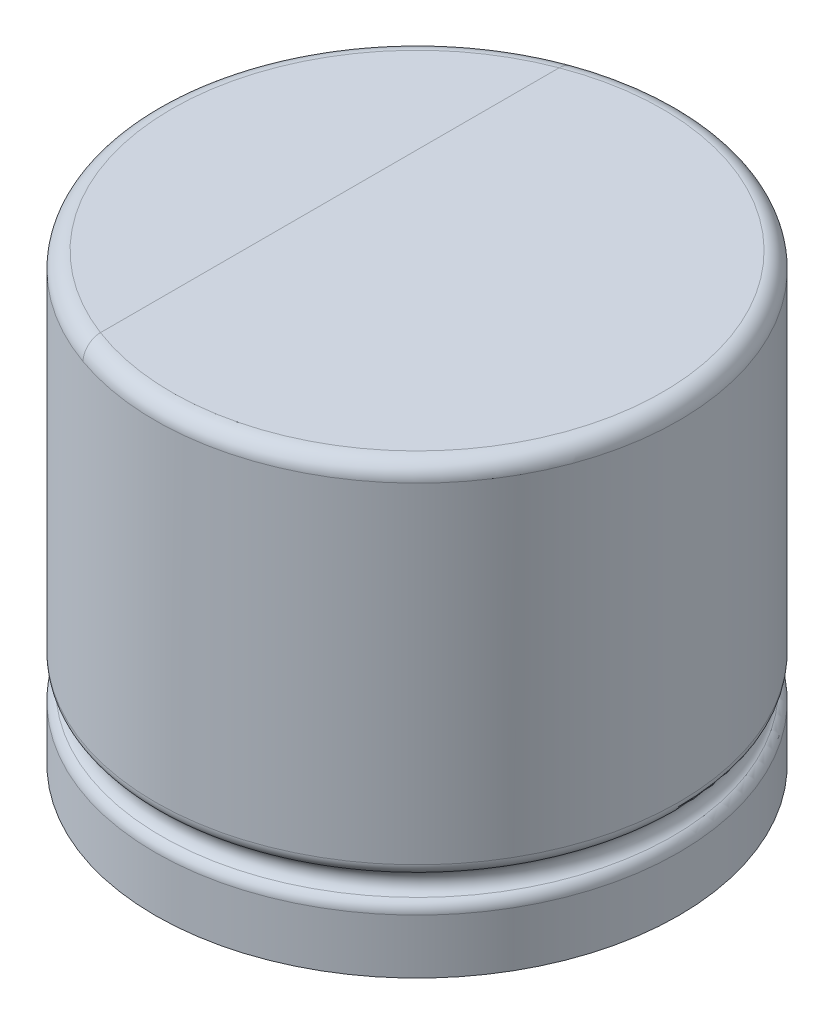
ISO-10303-21;
HEADER;
FILE_DESCRIPTION(('STEP AP214'),'2;1');
FILE_NAME('part.step','',(''),(''),'','','');
FILE_SCHEMA(('AUTOMOTIVE_DESIGN { 1 0 10303 214 1 1 1 1 }'));
ENDSEC;
DATA;
#1=APPLICATION_CONTEXT('core data for automotive mechanical design processes');
#2=APPLICATION_PROTOCOL_DEFINITION('international standard','automotive_design',2000,#1);
#3=PRODUCT_CONTEXT('',#1,'mechanical');
#4=PRODUCT('Part','Part','',(#3));
#5=PRODUCT_RELATED_PRODUCT_CATEGORY('part','',(#4));
#6=PRODUCT_DEFINITION_FORMATION('','',#4);
#7=PRODUCT_DEFINITION_CONTEXT('part definition',#1,'design');
#8=PRODUCT_DEFINITION('design','',#6,#7);
#9=PRODUCT_DEFINITION_SHAPE('','',#8);
#10=(LENGTH_UNIT() NAMED_UNIT(*) SI_UNIT(.MILLI.,.METRE.));
#11=(NAMED_UNIT(*) PLANE_ANGLE_UNIT() SI_UNIT($,.RADIAN.));
#12=(NAMED_UNIT(*) SI_UNIT($,.STERADIAN.) SOLID_ANGLE_UNIT());
#13=UNCERTAINTY_MEASURE_WITH_UNIT(LENGTH_MEASURE(1.E-05),#10,'distance_accuracy_value','');
#14=(GEOMETRIC_REPRESENTATION_CONTEXT(3) GLOBAL_UNCERTAINTY_ASSIGNED_CONTEXT((#13)) GLOBAL_UNIT_ASSIGNED_CONTEXT((#10,
#11,#12)) REPRESENTATION_CONTEXT('',''));
#15=CARTESIAN_POINT('',(0.,0.,0.));
#16=DIRECTION('',(0.,0.,1.));
#17=DIRECTION('',(1.,0.,0.));
#18=AXIS2_PLACEMENT_3D('',#15,#16,#17);
#19=CARTESIAN_POINT('',(0.,3.775,0.));
#20=DIRECTION('',(0.,-1.,0.));
#21=DIRECTION('',(1.,0.,0.));
#22=AXIS2_PLACEMENT_3D('',#19,#20,#21);
#23=TOROIDAL_SURFACE('',#22,1.875,0.125);
#24=CARTESIAN_POINT('',(0.,3.9,0.));
#25=DIRECTION('',(0.,-1.,0.));
#26=DIRECTION('',(1.,0.,0.));
#27=AXIS2_PLACEMENT_3D('',#24,#25,#26);
#28=CIRCLE('',#27,1.875);
#29=CARTESIAN_POINT('',(-0.666666666666666,3.9,-1.75247840373442));
#30=VERTEX_POINT('',#29);
#31=CARTESIAN_POINT('',(-0.666666666666666,3.9,1.75247840373442));
#32=VERTEX_POINT('',#31);
#33=EDGE_CURVE('E78',#30,#32,#28,.F.);
#34=ORIENTED_EDGE('',*,*,#33,.F.);
#35=CARTESIAN_POINT('',(-0.666666666666666,3.82818405447085,-1.87301424134918));
#36=CARTESIAN_POINT('',(-0.666666666666666,3.82220378949174,-1.87599836917153));
#37=CARTESIAN_POINT('',(-0.666666666666666,3.8159736785829,-1.87849018178));
#38=CARTESIAN_POINT('',(-0.666666666666666,3.80318033587419,-1.88239780078043));
#39=CARTESIAN_POINT('',(-0.666666666666666,3.7966168636358,-1.8838128184264));
#40=CARTESIAN_POINT('',(-0.666666666666666,3.78334184590753,-1.88551247272468));
#41=CARTESIAN_POINT('',(-0.666666666666666,3.77663024651199,-1.88579669080732));
#42=CARTESIAN_POINT('',(-0.666666666666666,3.76325744151217,-1.88522246223916));
#43=CARTESIAN_POINT('',(-0.666666666666666,3.75659622765533,-1.88436420697432));
#44=CARTESIAN_POINT('',(-0.666666666666666,3.74357097969995,-1.88155026522605));
#45=CARTESIAN_POINT('',(-0.666666666666666,3.73720487443214,-1.87960412946247));
#46=CARTESIAN_POINT('',(-0.666666666666666,3.7248803062502,-1.87469118754634));
#47=CARTESIAN_POINT('',(-0.666666666666666,3.71892187388207,-1.87172430501173));
#48=CARTESIAN_POINT('',(-0.666666666666666,3.70744704944748,-1.86480082139048));
#49=CARTESIAN_POINT('',(-0.666666666666666,3.70194198622153,-1.86082547894449));
#50=CARTESIAN_POINT('',(-0.666666666666666,3.69163935747781,-1.85204580705027));
#51=CARTESIAN_POINT('',(-0.666666666666666,3.68684192651719,-1.84724132031514));
#52=CARTESIAN_POINT('',(-0.666666666666666,3.67784441318641,-1.83670061253256));
#53=CARTESIAN_POINT('',(-0.666666666666666,3.67368349384132,-1.83093099013994));
#54=CARTESIAN_POINT('',(-0.666666666666666,3.66632618627092,-1.81880710639214));
#55=CARTESIAN_POINT('',(-0.666666666666666,3.66313005263974,-1.81245269129418));
#56=CARTESIAN_POINT('',(-0.666666666666666,3.65759555785682,-1.79893961078548));
#57=CARTESIAN_POINT('',(-0.666666666666666,3.65531903270807,-1.79175560988745));
#58=CARTESIAN_POINT('',(-0.666666666666666,3.65194002151267,-1.77711659255158));
#59=CARTESIAN_POINT('',(-0.666666666666666,3.65083785626396,-1.76966150263565));
#60=CARTESIAN_POINT('',(-0.666666666666666,3.64979377068687,-1.75429408830695));
#61=CARTESIAN_POINT('',(-0.666666666666666,3.64991278359446,-1.74637757758675));
#62=CARTESIAN_POINT('',(-0.666666666666666,3.65145039163617,-1.7306707109262));
#63=CARTESIAN_POINT('',(-0.666666666666666,3.65286923426461,-1.72288037929849));
#64=CARTESIAN_POINT('',(-0.666666666666666,3.65701827732434,-1.70749400569282));
#65=CARTESIAN_POINT('',(-0.666666666666666,3.65977322662498,-1.69990460279199));
#66=CARTESIAN_POINT('',(-0.666666666666666,3.66655132269711,-1.68531276226582));
#67=CARTESIAN_POINT('',(-0.666666666666666,3.6705744082658,-1.67831029633437));
#68=CARTESIAN_POINT('',(-0.666666666666666,3.67968164802173,-1.66530564748759));
#69=CARTESIAN_POINT('',(-0.666666666666666,3.68473494163925,-1.65928191555198));
#70=CARTESIAN_POINT('',(-0.666666666666666,3.69584548157831,-1.64824314939253));
#71=CARTESIAN_POINT('',(-0.666666666666666,3.7019023002272,-1.64322768748057));
#72=CARTESIAN_POINT('',(-0.666666666666666,3.71442172802686,-1.63471368758406));
#73=CARTESIAN_POINT('',(-0.666666666666666,3.72083094458236,-1.63113671935295));
#74=CARTESIAN_POINT('',(-0.666666666666666,3.73419285278215,-1.62520766784083));
#75=CARTESIAN_POINT('',(-0.666666666666666,3.74114525032432,-1.6228549269234));
#76=CARTESIAN_POINT('',(-0.666666666666666,3.75484865047754,-1.61960928837895));
#77=CARTESIAN_POINT('',(-0.666666666666666,3.76157755456963,-1.61862270266717));
#78=CARTESIAN_POINT('',(-0.666666666666666,3.77510352473261,-1.61784259513277));
#79=CARTESIAN_POINT('',(-0.666666666666666,3.78190057185393,-1.61804875033633));
#80=CARTESIAN_POINT('',(-0.666666666666666,3.79509778475981,-1.61961370156934));
#81=CARTESIAN_POINT('',(-0.666666666666666,3.80150323267639,-1.62092855274267));
#82=CARTESIAN_POINT('',(-0.666666666666666,3.81400760615145,-1.62459919495037));
#83=CARTESIAN_POINT('',(-0.666666666666666,3.82010652345878,-1.6269550139887));
#84=CARTESIAN_POINT('',(-0.666666666666666,3.83193448943692,-1.63266246000846));
#85=CARTESIAN_POINT('',(-0.666666666666666,3.83765633916544,-1.6360289572055));
#86=CARTESIAN_POINT('',(-0.666666666666666,3.84849385737944,-1.64362521055848));
#87=CARTESIAN_POINT('',(-0.666666666666666,3.85360939001308,-1.64785515960428));
#88=CARTESIAN_POINT('',(-0.666666666666666,3.86340626591912,-1.65731177384585));
#89=CARTESIAN_POINT('',(-0.666666666666666,3.86804575762332,-1.66258175119738));
#90=CARTESIAN_POINT('',(-0.666666666666666,3.87644508294144,-1.67378078227073));
#91=CARTESIAN_POINT('',(-0.666666666666666,3.88020463556838,-1.67971004563026));
#92=CARTESIAN_POINT('',(-0.666666666666666,3.88701724649157,-1.692512880006));
#93=CARTESIAN_POINT('',(-0.666666666666666,3.89000041514573,-1.69942366909962));
#94=CARTESIAN_POINT('',(-0.666666666666666,3.89483304545837,-1.71363104068431));
#95=CARTESIAN_POINT('',(-0.666666666666666,3.89668216590303,-1.72092773857148));
#96=CARTESIAN_POINT('',(-0.666666666666666,3.89928362280009,-1.73612753238553));
#97=CARTESIAN_POINT('',(-0.666666666666666,3.89997026371915,-1.7440419408726));
#98=CARTESIAN_POINT('',(-0.666666666666666,3.9000278518694,-1.75987631159834));
#99=CARTESIAN_POINT('',(-0.666666666666666,3.89939863591298,-1.76779627440407));
#100=CARTESIAN_POINT('',(-0.666666666666666,3.89680807836945,-1.78354047092162));
#101=CARTESIAN_POINT('',(-0.666666666666666,3.89482667237237,-1.7913614295894));
#102=CARTESIAN_POINT('',(-0.666666666666666,3.8895397617829,-1.80654630054681));
#103=CARTESIAN_POINT('',(-0.666666666666666,3.88623404623419,-1.8139101398035));
#104=CARTESIAN_POINT('',(-0.666666666666666,3.87847679381382,-1.82773367746721));
#105=CARTESIAN_POINT('',(-0.666666666666666,3.87406047897215,-1.83421311935853));
#106=CARTESIAN_POINT('',(-0.666666666666666,3.86414417413304,-1.84627309792243));
#107=CARTESIAN_POINT('',(-0.666666666666666,3.85864598146363,-1.85185509794345));
#108=CARTESIAN_POINT('',(-0.666666666666666,3.8489369949788,-1.86003947772965));
#109=CARTESIAN_POINT('',(-0.666666666666666,3.84500566965683,-1.86297885266937));
#110=CARTESIAN_POINT('',(-0.666666666666666,3.83682237020493,-1.86837182836929));
#111=CARTESIAN_POINT('',(-0.666666666666666,3.83257041876749,-1.87082546346353));
#112=CARTESIAN_POINT('',(-0.666666666666666,3.82818405447085,-1.87301424134918));
#113=B_SPLINE_CURVE_WITH_KNOTS('',3,(#35,#36,#37,#38,#39,#40,#41,#42,#43,#44,#45,#46,#47,#48,
#49,#50,#51,#52,#53,#54,#55,#56,#57,#58,#59,#60,#61,#62,#63,#64,#65,#66,#67,#68,#69,#70,#71,#72,
#73,#74,#75,#76,#77,#78,#79,#80,#81,#82,#83,#84,#85,#86,#87,#88,#89,#90,#91,#92,#93,#94,#95,#96,
#97,#98,#99,#100,#101,#102,#103,#104,#105,#106,#107,#108,#109,#110,#111,#112),.UNSPECIFIED.,.T.,
.F.,(4,2,2,2,2,2,2,2,2,2,2,2,2,2,2,2,2,2,2,2,2,2,2,2,2,2,2,2,2,2,2,2,2,2,2,2,2,2,4),(0.,
0.0200331153309485,0.0400808907137164,0.0601360861653706,0.0801879224140654,0.100066423439525,
0.119946412288637,0.140227054916742,0.160511548976644,0.181758877687329,0.203011808394073,
0.225520411649499,0.248035161967483,0.271678583774686,0.295326508348133,0.319430238841597,
0.343532806218867,0.366998225037598,0.390453669191701,0.412356642244206,0.434247837172202,
0.454547691158985,0.474842048550099,0.494367881327073,0.513894239417104,0.53372328098479,
0.553556757096042,0.574530123613579,0.595510178352282,0.617992928702707,0.640482440376354,
0.664205048562899,0.687930598912524,0.712016081489848,0.736105402298725,0.759510325448877,
0.782876689282317,0.797571482236727,0.812265236133134),.UNSPECIFIED.);
#114=CARTESIAN_POINT('',(-0.666666666666666,3.775,-1.88561808316413));
#115=VERTEX_POINT('',#114);
#116=EDGE_CURVE('E11',#30,#115,#113,.T.);
#117=ORIENTED_EDGE('',*,*,#116,.T.);
#118=CARTESIAN_POINT('',(0.,3.775,0.));
#119=DIRECTION('',(0.,-1.,0.));
#120=DIRECTION('',(1.,0.,0.));
#121=AXIS2_PLACEMENT_3D('',#118,#119,#120);
#122=CIRCLE('',#121,2.);
#123=CARTESIAN_POINT('',(-0.666666666666666,3.775,1.88561808316413));
#124=VERTEX_POINT('',#123);
#125=EDGE_CURVE('E83',#124,#115,#122,.T.);
#126=ORIENTED_EDGE('',*,*,#125,.F.);
#127=CARTESIAN_POINT('',(-0.666666666666666,3.79956255640499,1.62067612773196));
#128=CARTESIAN_POINT('',(-0.666666666666666,3.79317130974612,1.61929146965819));
#129=CARTESIAN_POINT('',(-0.666666666666666,3.78665926171825,1.61844439341232));
#130=CARTESIAN_POINT('',(-0.666666666666666,3.773581624128,1.6178638647447));
#131=CARTESIAN_POINT('',(-0.666666666666666,3.76701599226971,1.61813139886323));
#132=CARTESIAN_POINT('',(-0.666666666666666,3.75402957724054,1.61976941866287));
#133=CARTESIAN_POINT('',(-0.666666666666666,3.74760867621762,1.6211389709796));
#134=CARTESIAN_POINT('',(-0.666666666666666,3.73508500035388,1.62492361071983));
#135=CARTESIAN_POINT('',(-0.666666666666666,3.72898219972996,1.62733861325794));
#136=CARTESIAN_POINT('',(-0.666666666666666,3.71717433183171,1.6331588083544));
#137=CARTESIAN_POINT('',(-0.666666666666666,3.71147524250004,1.6365760898937));
#138=CARTESIAN_POINT('',(-0.666666666666666,3.70069041959812,1.64426898649964));
#139=CARTESIAN_POINT('',(-0.666666666666666,3.69560482558833,1.64854479628061));
#140=CARTESIAN_POINT('',(-0.666666666666666,3.68587173097454,1.65809376626394));
#141=CARTESIAN_POINT('',(-0.666666666666666,3.68126706449193,1.66341054281063));
#142=CARTESIAN_POINT('',(-0.666666666666666,3.67294427916246,1.67469721104688));
#143=CARTESIAN_POINT('',(-0.666666666666666,3.6692264469322,1.6806673129782));
#144=CARTESIAN_POINT('',(-0.666666666666666,3.66250672491225,1.69354752529332));
#145=CARTESIAN_POINT('',(-0.666666666666666,3.65957511436002,1.7004943313314));
#146=CARTESIAN_POINT('',(-0.666666666666666,3.65485158234335,1.71476532977014));
#147=CARTESIAN_POINT('',(-0.666666666666666,3.65305999820317,1.72208963317676));
#148=CARTESIAN_POINT('',(-0.666666666666666,3.6505831141384,1.73733065732365));
#149=CARTESIAN_POINT('',(-0.666666666666666,3.64996279863653,1.74525800774872));
#150=CARTESIAN_POINT('',(-0.666666666666666,3.65004066772871,1.76110730592935));
#151=CARTESIAN_POINT('',(-0.666666666666666,3.65073905805042,1.76902925264902));
#152=CARTESIAN_POINT('',(-0.666666666666666,3.65346936037002,1.78475691726484));
#153=CARTESIAN_POINT('',(-0.666666666666666,3.65551994671776,1.79255941864692));
#154=CARTESIAN_POINT('',(-0.666666666666666,3.66094170086204,1.80769286276305));
#155=CARTESIAN_POINT('',(-0.666666666666666,3.66431272825127,1.81502385553787));
#156=CARTESIAN_POINT('',(-0.666666666666666,3.67218811798043,1.82876046970703));
#157=CARTESIAN_POINT('',(-0.666666666666666,3.67665553961067,1.83518722040471));
#158=CARTESIAN_POINT('',(-0.666666666666666,3.68666736577195,1.84713990522625));
#159=CARTESIAN_POINT('',(-0.666666666666666,3.69221139079882,1.85266615551897));
#160=CARTESIAN_POINT('',(-0.666666666666666,3.70387565575397,1.86231314490482));
#161=CARTESIAN_POINT('',(-0.666666666666666,3.7099438310382,1.86649680962946));
#162=CARTESIAN_POINT('',(-0.666666666666666,3.72273101455996,1.87371095902517));
#163=CARTESIAN_POINT('',(-0.666666666666666,3.72944976413965,1.87674189965811));
#164=CARTESIAN_POINT('',(-0.666666666666666,3.74291963715963,1.88138397743785));
#165=CARTESIAN_POINT('',(-0.666666666666666,3.74964567104303,1.8830680632042));
#166=CARTESIAN_POINT('',(-0.666666666666666,3.76328802567636,1.88523727593779));
#167=CARTESIAN_POINT('',(-0.666666666666666,3.77020429886944,1.8857226998464));
#168=CARTESIAN_POINT('',(-0.666666666666666,3.78377165589035,1.88548005116799));
#169=CARTESIAN_POINT('',(-0.666666666666666,3.79042353353868,1.8847939389435));
#170=CARTESIAN_POINT('',(-0.666666666666666,3.80351681897049,1.88231409736424));
#171=CARTESIAN_POINT('',(-0.666666666666666,3.80995823674354,1.8805204206611));
#172=CARTESIAN_POINT('',(-0.666666666666666,3.8224547914697,1.87589042706059));
#173=CARTESIAN_POINT('',(-0.666666666666666,3.82850986296367,1.87305393402511));
#174=CARTESIAN_POINT('',(-0.666666666666666,3.84007859168928,1.86643610963306));
#175=CARTESIAN_POINT('',(-0.666666666666666,3.84559218353078,1.86265466435719));
#176=CARTESIAN_POINT('',(-0.666666666666666,3.85612324613175,1.85412748139996));
#177=CARTESIAN_POINT('',(-0.666666666666666,3.86111807622109,1.84935382114359));
#178=CARTESIAN_POINT('',(-0.666666666666666,3.87028579778322,1.83907444783566));
#179=CARTESIAN_POINT('',(-0.666666666666666,3.87445850128344,1.8335685678489));
#180=CARTESIAN_POINT('',(-0.666666666666666,3.88210754626067,1.82166213185984));
#181=CARTESIAN_POINT('',(-0.666666666666666,3.88553334493048,1.81522911961735));
#182=CARTESIAN_POINT('',(-0.666666666666666,3.89132403036097,1.80190249547069));
#183=CARTESIAN_POINT('',(-0.666666666666666,3.89368861993104,1.7950087551603));
#184=CARTESIAN_POINT('',(-0.666666666666666,3.89742802401509,1.78053010637771));
#185=CARTESIAN_POINT('',(-0.666666666666666,3.89873750966564,1.7729282979033));
#186=CARTESIAN_POINT('',(-0.666666666666666,3.90011521101244,1.75761261835049));
#187=CARTESIAN_POINT('',(-0.666666666666666,3.90018311648165,1.74989871974658));
#188=CARTESIAN_POINT('',(-0.666666666666666,3.89906036534419,1.73425518274846));
#189=CARTESIAN_POINT('',(-0.666666666666666,3.8978198448036,1.72632907220027));
#190=CARTESIAN_POINT('',(-0.666666666666666,3.89402817358005,1.71079545715085));
#191=CARTESIAN_POINT('',(-0.666666666666666,3.89147692016856,1.70318797767284));
#192=CARTESIAN_POINT('',(-0.666666666666666,3.88511061256345,1.68851386002635));
#193=CARTESIAN_POINT('',(-0.666666666666666,3.88129477900252,1.68144755870333));
#194=CARTESIAN_POINT('',(-0.666666666666666,3.87247586271153,1.66809393658334));
#195=CARTESIAN_POINT('',(-0.666666666666666,3.86747270401985,1.66180666566567));
#196=CARTESIAN_POINT('',(-0.666666666666666,3.85665057300873,1.65051418839769));
#197=CARTESIAN_POINT('',(-0.666666666666666,3.85087873716912,1.64546385534327));
#198=CARTESIAN_POINT('',(-0.666666666666666,3.83851664556508,1.63650385420999));
#199=CARTESIAN_POINT('',(-0.666666666666666,3.83192799804019,1.63259199387251));
#200=CARTESIAN_POINT('',(-0.666666666666666,3.82097044503274,1.6274195142298));
#201=CARTESIAN_POINT('',(-0.666666666666666,3.81679942472739,1.62572954466143));
#202=CARTESIAN_POINT('',(-0.666666666666666,3.80829214371702,1.62283376823363));
#203=CARTESIAN_POINT('',(-0.666666666666666,3.80395589040117,1.62162793975132));
#204=CARTESIAN_POINT('',(-0.666666666666666,3.79956255640499,1.62067612773196));
#205=B_SPLINE_CURVE_WITH_KNOTS('',3,(#127,#128,#129,#130,#131,#132,#133,#134,#135,#136,#137,
#138,#139,#140,#141,#142,#143,#144,#145,#146,#147,#148,#149,#150,#151,#152,#153,#154,#155,#156,
#157,#158,#159,#160,#161,#162,#163,#164,#165,#166,#167,#168,#169,#170,#171,#172,#173,#174,#175,
#176,#177,#178,#179,#180,#181,#182,#183,#184,#185,#186,#187,#188,#189,#190,#191,#192,#193,#194,
#195,#196,#197,#198,#199,#200,#201,#202,#203,#204),.UNSPECIFIED.,.T.,.F.,(4,2,2,2,2,2,2,2,2,2,2,
2,2,2,2,2,2,2,2,2,2,2,2,2,2,2,2,2,2,2,2,2,2,2,2,2,2,2,4),(0.,0.0196021202708034,
0.039221594038596,0.0588244683822836,0.0784257513680005,0.0982739259947386,0.118126607285576,
0.139136852022749,0.160153877903413,0.182675016809758,0.205202816437367,0.228947478016636,
0.252695844241403,0.276779252970385,0.300860101517367,0.324220206447802,0.347572091808168,
0.369569681205391,0.391558560348751,0.412255662183122,0.43294763626378,0.452913941661108,
0.472879297969195,0.492848028099523,0.512819166734964,0.533455480098995,0.554096506326683,
0.575866000416849,0.597641587234901,0.620679597005952,0.643723363083604,0.667678174387619,
0.691634863433542,0.715606344654417,0.739579359914831,0.762468037836991,0.785312344880304,
0.798787416777597,0.812261886780023),.UNSPECIFIED.);
#206=EDGE_CURVE('E51',#124,#32,#205,.T.);
#207=ORIENTED_EDGE('',*,*,#206,.T.);
#208=EDGE_LOOP('',(#34,#117,#126,#207));
#209=FACE_BOUND('',#208,.T.);
#210=ADVANCED_FACE('F41',(#209),#23,.T.);
#211=CARTESIAN_POINT('',(0.,3.9,0.));
#212=DIRECTION('',(0.,-1.,0.));
#213=DIRECTION('',(1.,0.,0.));
#214=AXIS2_PLACEMENT_3D('',#211,#212,#213);
#215=PLANE('',#214);
#216=DIRECTION('',(0.,0.,1.));
#217=VECTOR('',#216,1.);
#218=CARTESIAN_POINT('',(-0.666666666666666,3.9,0.));
#219=LINE('',#218,#217);
#220=EDGE_CURVE('E45',#30,#32,#219,.T.);
#221=ORIENTED_EDGE('',*,*,#220,.F.);
#222=ORIENTED_EDGE('',*,*,#33,.T.);
#223=EDGE_LOOP('',(#221,#222));
#224=FACE_BOUND('',#223,.T.);
#225=ADVANCED_FACE('F77',(#224),#215,.F.);
#226=EDGE_CURVE('E71',#32,#30,#28,.F.);
#227=ORIENTED_EDGE('',*,*,#226,.T.);
#228=ORIENTED_EDGE('',*,*,#220,.T.);
#229=EDGE_LOOP('',(#227,#228));
#230=FACE_BOUND('',#229,.T.);
#231=ADVANCED_FACE('F81',(#230),#215,.F.);
#232=CARTESIAN_POINT('',(0.,0.500000000048987,0.));
#233=DIRECTION('',(0.,-1.,0.));
#234=DIRECTION('',(1.,0.,0.));
#235=AXIS2_PLACEMENT_3D('',#232,#233,#234);
#236=CYLINDRICAL_SURFACE('',#235,2.);
#237=ORIENTED_EDGE('',*,*,#125,.T.);
#238=EDGE_CURVE('E73',#115,#124,#122,.T.);
#239=ORIENTED_EDGE('',*,*,#238,.T.);
#240=EDGE_LOOP('',(#237,#239));
#241=FACE_BOUND('',#240,.T.);
#242=CARTESIAN_POINT('',(0.,1.25,0.));
#243=DIRECTION('',(0.,-1.,0.));
#244=DIRECTION('',(0.,0.,-1.));
#245=AXIS2_PLACEMENT_3D('',#242,#243,#244);
#246=CIRCLE('',#245,2.00000000000999);
#247=CARTESIAN_POINT('',(0.,1.25,-2.00000000000999));
#248=VERTEX_POINT('',#247);
#249=EDGE_CURVE('E222',#248,#248,#246,.T.);
#250=ORIENTED_EDGE('',*,*,#249,.F.);
#251=EDGE_LOOP('',(#250));
#252=FACE_BOUND('',#251,.T.);
#253=ADVANCED_FACE('F103',(#241,#252),#236,.T.);
#254=CARTESIAN_POINT('',(0.,1.25,0.));
#255=DIRECTION('',(0.,-1.,0.));
#256=DIRECTION('',(0.,0.,-1.));
#257=AXIS2_PLACEMENT_3D('',#254,#255,#256);
#258=TOROIDAL_SURFACE('',#257,1.90377495513173,0.0962250448732673);
#259=ORIENTED_EDGE('',*,*,#249,.T.);
#260=EDGE_LOOP('',(#259));
#261=FACE_BOUND('',#260,.T.);
#262=CARTESIAN_POINT('',(0.,1.16666666666667,0.));
#263=DIRECTION('',(0.,-1.,0.));
#264=DIRECTION('',(0.,0.,-1.));
#265=AXIS2_PLACEMENT_3D('',#262,#263,#264);
#266=CIRCLE('',#265,1.95188747757086);
#267=CARTESIAN_POINT('',(0.,1.16666666666667,-1.95188747757086));
#268=VERTEX_POINT('',#267);
#269=EDGE_CURVE('E225',#268,#268,#266,.T.);
#270=ORIENTED_EDGE('',*,*,#269,.F.);
#271=EDGE_LOOP('',(#270));
#272=FACE_BOUND('',#271,.T.);
#273=ADVANCED_FACE('F106',(#261,#272),#258,.T.);
#274=CARTESIAN_POINT('',(0.,1.08333333333333,0.));
#275=DIRECTION('',(0.,-1.,0.));
#276=DIRECTION('',(0.,0.,-1.));
#277=AXIS2_PLACEMENT_3D('',#274,#275,#276);
#278=TOROIDAL_SURFACE('',#277,2.00000000000999,0.0962250448682694);
#279=ORIENTED_EDGE('',*,*,#269,.T.);
#280=EDGE_LOOP('',(#279));
#281=FACE_BOUND('',#280,.T.);
#282=CARTESIAN_POINT('',(0.,1.00000000000433,0.));
#283=DIRECTION('',(0.,-1.,0.));
#284=DIRECTION('',(0.,0.,-1.));
#285=AXIS2_PLACEMENT_3D('',#282,#283,#284);
#286=CIRCLE('',#285,1.95188747757336);
#287=CARTESIAN_POINT('',(0.,1.00000000000433,-1.95188747757336));
#288=VERTEX_POINT('',#287);
#289=EDGE_CURVE('E221',#288,#288,#286,.T.);
#290=ORIENTED_EDGE('',*,*,#289,.F.);
#291=EDGE_LOOP('',(#290));
#292=FACE_BOUND('',#291,.T.);
#293=ADVANCED_FACE('F115',(#281,#292),#278,.F.);
#294=CARTESIAN_POINT('',(0.,0.916666666666667,0.));
#295=DIRECTION('',(0.,-1.,0.));
#296=DIRECTION('',(0.,0.,-1.));
#297=AXIS2_PLACEMENT_3D('',#294,#295,#296);
#298=TOROIDAL_SURFACE('',#297,1.90377495513173,0.0962250448732673);
#299=ORIENTED_EDGE('',*,*,#289,.T.);
#300=EDGE_LOOP('',(#299));
#301=FACE_BOUND('',#300,.T.);
#302=CARTESIAN_POINT('',(0.,0.916666666666667,0.));
#303=DIRECTION('',(0.,-1.,0.));
#304=DIRECTION('',(0.,0.,-1.));
#305=AXIS2_PLACEMENT_3D('',#302,#303,#304);
#306=CIRCLE('',#305,2.00000000000999);
#307=CARTESIAN_POINT('',(0.,0.916666666666667,-2.00000000000999));
#308=VERTEX_POINT('',#307);
#309=EDGE_CURVE('E220',#308,#308,#306,.T.);
#310=ORIENTED_EDGE('',*,*,#309,.F.);
#311=EDGE_LOOP('',(#310));
#312=FACE_BOUND('',#311,.T.);
#313=ADVANCED_FACE('F111',(#301,#312),#298,.T.);
#314=CARTESIAN_POINT('',(0.,0.500000000048987,0.));
#315=DIRECTION('',(0.,1.,0.));
#316=DIRECTION('',(-1.,0.,0.));
#317=AXIS2_PLACEMENT_3D('',#314,#315,#316);
#318=PLANE('',#317);
#319=CARTESIAN_POINT('',(0.,0.500000000048986,0.));
#320=DIRECTION('',(0.,-1.,0.));
#321=DIRECTION('',(1.,0.,0.));
#322=AXIS2_PLACEMENT_3D('',#319,#320,#321);
#323=CIRCLE('',#322,2.);
#324=CARTESIAN_POINT('',(2.,0.500000000048986,0.));
#325=VERTEX_POINT('',#324);
#326=EDGE_CURVE('E217',#325,#325,#323,.T.);
#327=ORIENTED_EDGE('',*,*,#326,.T.);
#328=EDGE_LOOP('',(#327));
#329=FACE_BOUND('',#328,.T.);
#330=ADVANCED_FACE('F108',(#329),#318,.F.);
#331=ORIENTED_EDGE('',*,*,#326,.F.);
#332=EDGE_LOOP('',(#331));
#333=FACE_BOUND('',#332,.T.);
#334=ORIENTED_EDGE('',*,*,#309,.T.);
#335=EDGE_LOOP('',(#334));
#336=FACE_BOUND('',#335,.T.);
#337=ADVANCED_FACE('F99',(#333,#336),#236,.T.);
#338=ORIENTED_EDGE('',*,*,#116,.F.);
#339=ORIENTED_EDGE('',*,*,#226,.F.);
#340=ORIENTED_EDGE('',*,*,#206,.F.);
#341=ORIENTED_EDGE('',*,*,#238,.F.);
#342=EDGE_LOOP('',(#338,#339,#340,#341));
#343=FACE_BOUND('',#342,.T.);
#344=ADVANCED_FACE('F69',(#343),#23,.T.);
#345=CLOSED_SHELL('',(#210,#225,#231,#253,#273,#293,#313,#330,#337,#344));
#346=MANIFOLD_SOLID_BREP('B2',#345);
#347=ADVANCED_BREP_SHAPE_REPRESENTATION('',(#18,#346),#14);
#348=SHAPE_DEFINITION_REPRESENTATION(#9,#347);
ENDSEC;
END-ISO-10303-21;
